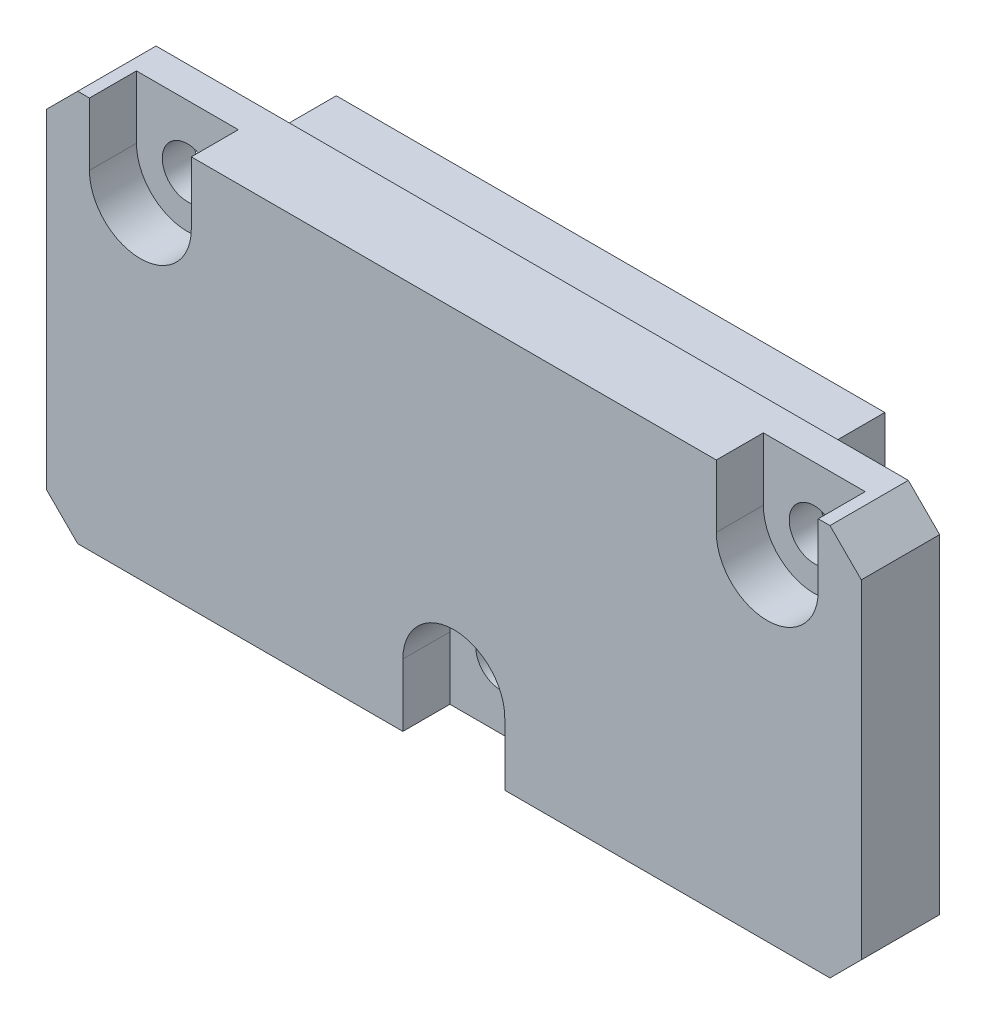
ISO-10303-21;
HEADER;
FILE_DESCRIPTION(('STEP AP214'),'2;1');
FILE_NAME('part.step','',(''),(''),'','','');
FILE_SCHEMA(('AUTOMOTIVE_DESIGN { 1 0 10303 214 1 1 1 1 }'));
ENDSEC;
DATA;
#1=APPLICATION_CONTEXT('core data for automotive mechanical design processes');
#2=APPLICATION_PROTOCOL_DEFINITION('international standard','automotive_design',2000,#1);
#3=PRODUCT_CONTEXT('',#1,'mechanical');
#4=PRODUCT('Part','Part','',(#3));
#5=PRODUCT_RELATED_PRODUCT_CATEGORY('part','',(#4));
#6=PRODUCT_DEFINITION_FORMATION('','',#4);
#7=PRODUCT_DEFINITION_CONTEXT('part definition',#1,'design');
#8=PRODUCT_DEFINITION('design','',#6,#7);
#9=PRODUCT_DEFINITION_SHAPE('','',#8);
#10=(LENGTH_UNIT() NAMED_UNIT(*) SI_UNIT(.MILLI.,.METRE.));
#11=(NAMED_UNIT(*) PLANE_ANGLE_UNIT() SI_UNIT($,.RADIAN.));
#12=(NAMED_UNIT(*) SI_UNIT($,.STERADIAN.) SOLID_ANGLE_UNIT());
#13=UNCERTAINTY_MEASURE_WITH_UNIT(LENGTH_MEASURE(1.E-05),#10,'distance_accuracy_value','');
#14=(GEOMETRIC_REPRESENTATION_CONTEXT(3) GLOBAL_UNCERTAINTY_ASSIGNED_CONTEXT((#13)) GLOBAL_UNIT_ASSIGNED_CONTEXT((#10,
#11,#12)) REPRESENTATION_CONTEXT('',''));
#15=CARTESIAN_POINT('',(0.,0.,0.));
#16=DIRECTION('',(0.,0.,1.));
#17=DIRECTION('',(1.,0.,0.));
#18=AXIS2_PLACEMENT_3D('',#15,#16,#17);
#19=CARTESIAN_POINT('',(-26.,12.5,5.));
#20=DIRECTION('',(0.,-1.,0.));
#21=DIRECTION('',(0.,0.,-1.));
#22=AXIS2_PLACEMENT_3D('',#19,#20,#21);
#23=PLANE('',#22);
#24=DIRECTION('',(0.,0.,1.));
#25=VECTOR('',#24,1.);
#26=CARTESIAN_POINT('',(16.75,12.5,2.));
#27=LINE('',#26,#25);
#28=CARTESIAN_POINT('',(16.75,12.5,2.));
#29=VERTEX_POINT('',#28);
#30=CARTESIAN_POINT('',(16.75,12.5,5.));
#31=VERTEX_POINT('',#30);
#32=EDGE_CURVE('E229',#29,#31,#27,.T.);
#33=ORIENTED_EDGE('',*,*,#32,.F.);
#34=DIRECTION('',(-1.,0.,0.));
#35=VECTOR('',#34,1.);
#36=CARTESIAN_POINT('',(0.,12.5,2.));
#37=LINE('',#36,#35);
#38=CARTESIAN_POINT('',(23.25,12.5,2.));
#39=VERTEX_POINT('',#38);
#40=EDGE_CURVE('E210',#39,#29,#37,.T.);
#41=ORIENTED_EDGE('',*,*,#40,.F.);
#42=DIRECTION('',(0.,0.,1.));
#43=VECTOR('',#42,1.);
#44=CARTESIAN_POINT('',(23.25,12.5,2.));
#45=LINE('',#44,#43);
#46=CARTESIAN_POINT('',(23.25,12.5,5.));
#47=VERTEX_POINT('',#46);
#48=EDGE_CURVE('E200',#39,#47,#45,.T.);
#49=ORIENTED_EDGE('',*,*,#48,.T.);
#50=DIRECTION('',(-1.,0.,0.));
#51=VECTOR('',#50,1.);
#52=CARTESIAN_POINT('',(-26.,12.5,5.));
#53=LINE('',#52,#51);
#54=CARTESIAN_POINT('',(24.,12.5,5.));
#55=VERTEX_POINT('',#54);
#56=EDGE_CURVE('E321',#55,#47,#53,.T.);
#57=ORIENTED_EDGE('',*,*,#56,.F.);
#58=DIRECTION('',(0.,0.,-1.));
#59=VECTOR('',#58,1.);
#60=CARTESIAN_POINT('',(24.,12.5,5.));
#61=LINE('',#60,#59);
#62=CARTESIAN_POINT('',(24.,12.5,0.));
#63=VERTEX_POINT('',#62);
#64=EDGE_CURVE('E42',#55,#63,#61,.T.);
#65=ORIENTED_EDGE('',*,*,#64,.T.);
#66=DIRECTION('',(-1.,0.,0.));
#67=VECTOR('',#66,1.);
#68=CARTESIAN_POINT('',(-26.,12.5,0.));
#69=LINE('',#68,#67);
#70=CARTESIAN_POINT('',(-24.,12.5,0.));
#71=VERTEX_POINT('',#70);
#72=EDGE_CURVE('E335',#63,#71,#69,.T.);
#73=ORIENTED_EDGE('',*,*,#72,.T.);
#74=DIRECTION('',(0.,0.,1.));
#75=VECTOR('',#74,1.);
#76=CARTESIAN_POINT('',(-24.,12.5,5.));
#77=LINE('',#76,#75);
#78=CARTESIAN_POINT('',(-24.,12.5,5.));
#79=VERTEX_POINT('',#78);
#80=EDGE_CURVE('E11',#71,#79,#77,.T.);
#81=ORIENTED_EDGE('',*,*,#80,.T.);
#82=CARTESIAN_POINT('',(-23.25,12.5,5.));
#83=VERTEX_POINT('',#82);
#84=EDGE_CURVE('E319',#83,#79,#53,.T.);
#85=ORIENTED_EDGE('',*,*,#84,.F.);
#86=DIRECTION('',(0.,0.,1.));
#87=VECTOR('',#86,1.);
#88=CARTESIAN_POINT('',(-23.25,12.5,2.));
#89=LINE('',#88,#87);
#90=CARTESIAN_POINT('',(-23.25,12.5,2.));
#91=VERTEX_POINT('',#90);
#92=EDGE_CURVE('E250',#91,#83,#89,.T.);
#93=ORIENTED_EDGE('',*,*,#92,.F.);
#94=DIRECTION('',(-1.,0.,0.));
#95=VECTOR('',#94,1.);
#96=CARTESIAN_POINT('',(0.,12.5,2.));
#97=LINE('',#96,#95);
#98=CARTESIAN_POINT('',(-16.75,12.5,2.));
#99=VERTEX_POINT('',#98);
#100=EDGE_CURVE('E240',#99,#91,#97,.T.);
#101=ORIENTED_EDGE('',*,*,#100,.F.);
#102=DIRECTION('',(0.,0.,1.));
#103=VECTOR('',#102,1.);
#104=CARTESIAN_POINT('',(-16.75,12.5,2.));
#105=LINE('',#104,#103);
#106=CARTESIAN_POINT('',(-16.75,12.5,5.));
#107=VERTEX_POINT('',#106);
#108=EDGE_CURVE('E253',#99,#107,#105,.T.);
#109=ORIENTED_EDGE('',*,*,#108,.T.);
#110=EDGE_CURVE('E325',#31,#107,#53,.T.);
#111=ORIENTED_EDGE('',*,*,#110,.F.);
#112=EDGE_LOOP('',(#33,#41,#49,#57,#65,#73,#81,#85,#93,#101,#109,#111));
#113=FACE_BOUND('',#112,.T.);
#114=ADVANCED_FACE('F34',(#113),#23,.F.);
#115=CARTESIAN_POINT('',(0.,0.,5.));
#116=DIRECTION('',(0.,0.,-1.));
#117=DIRECTION('',(-1.,0.,0.));
#118=AXIS2_PLACEMENT_3D('',#115,#116,#117);
#119=PLANE('',#118);
#120=DIRECTION('',(0.,1.,0.));
#121=VECTOR('',#120,1.);
#122=CARTESIAN_POINT('',(16.75,0.,5.));
#123=LINE('',#122,#121);
#124=CARTESIAN_POINT('',(16.75,8.5,5.));
#125=VERTEX_POINT('',#124);
#126=EDGE_CURVE('E214',#125,#31,#123,.T.);
#127=ORIENTED_EDGE('',*,*,#126,.T.);
#128=ORIENTED_EDGE('',*,*,#110,.T.);
#129=DIRECTION('',(0.,-1.,0.));
#130=VECTOR('',#129,1.);
#131=CARTESIAN_POINT('',(-16.75,0.,5.));
#132=LINE('',#131,#130);
#133=CARTESIAN_POINT('',(-16.75,8.5,5.));
#134=VERTEX_POINT('',#133);
#135=EDGE_CURVE('E235',#107,#134,#132,.T.);
#136=ORIENTED_EDGE('',*,*,#135,.T.);
#137=CARTESIAN_POINT('',(-20.,8.5,5.));
#138=DIRECTION('',(0.,0.,1.));
#139=DIRECTION('',(1.,0.,0.));
#140=AXIS2_PLACEMENT_3D('',#137,#138,#139);
#141=CIRCLE('',#140,3.25);
#142=CARTESIAN_POINT('',(-23.25,8.5,5.));
#143=VERTEX_POINT('',#142);
#144=EDGE_CURVE('E245',#143,#134,#141,.T.);
#145=ORIENTED_EDGE('',*,*,#144,.F.);
#146=DIRECTION('',(0.,1.,0.));
#147=VECTOR('',#146,1.);
#148=CARTESIAN_POINT('',(-23.25,0.,5.));
#149=LINE('',#148,#147);
#150=EDGE_CURVE('E57',#143,#83,#149,.T.);
#151=ORIENTED_EDGE('',*,*,#150,.T.);
#152=ORIENTED_EDGE('',*,*,#84,.T.);
#153=DIRECTION('',(0.707106781186549,0.707106781186546,0.));
#154=VECTOR('',#153,1.);
#155=CARTESIAN_POINT('',(-26.,10.5,5.));
#156=LINE('',#155,#154);
#157=CARTESIAN_POINT('',(-26.,10.5,5.));
#158=VERTEX_POINT('',#157);
#159=EDGE_CURVE('E363',#79,#158,#156,.F.);
#160=ORIENTED_EDGE('',*,*,#159,.T.);
#161=DIRECTION('',(0.,-1.,0.));
#162=VECTOR('',#161,1.);
#163=CARTESIAN_POINT('',(-26.,-12.5,5.));
#164=LINE('',#163,#162);
#165=CARTESIAN_POINT('',(-26.,-10.5,5.));
#166=VERTEX_POINT('',#165);
#167=EDGE_CURVE('E324',#158,#166,#164,.T.);
#168=ORIENTED_EDGE('',*,*,#167,.T.);
#169=DIRECTION('',(-0.707106781186545,0.70710678118655,0.));
#170=VECTOR('',#169,1.);
#171=CARTESIAN_POINT('',(-24.,-12.5,5.));
#172=LINE('',#171,#170);
#173=CARTESIAN_POINT('',(-24.,-12.5,5.));
#174=VERTEX_POINT('',#173);
#175=EDGE_CURVE('E365',#166,#174,#172,.F.);
#176=ORIENTED_EDGE('',*,*,#175,.T.);
#177=DIRECTION('',(1.,0.,0.));
#178=VECTOR('',#177,1.);
#179=CARTESIAN_POINT('',(-26.,-12.5,5.));
#180=LINE('',#179,#178);
#181=CARTESIAN_POINT('',(-3.25,-12.5,5.));
#182=VERTEX_POINT('',#181);
#183=EDGE_CURVE('E329',#174,#182,#180,.T.);
#184=ORIENTED_EDGE('',*,*,#183,.T.);
#185=DIRECTION('',(0.,-1.,0.));
#186=VECTOR('',#185,1.);
#187=CARTESIAN_POINT('',(-3.25,0.,5.));
#188=LINE('',#187,#186);
#189=CARTESIAN_POINT('',(-3.25,-8.5,5.));
#190=VERTEX_POINT('',#189);
#191=EDGE_CURVE('E273',#190,#182,#188,.T.);
#192=ORIENTED_EDGE('',*,*,#191,.F.);
#193=CARTESIAN_POINT('',(0.,-8.5,5.));
#194=DIRECTION('',(0.,0.,1.));
#195=DIRECTION('',(1.,0.,0.));
#196=AXIS2_PLACEMENT_3D('',#193,#194,#195);
#197=CIRCLE('',#196,3.25);
#198=CARTESIAN_POINT('',(3.25,-8.5,5.));
#199=VERTEX_POINT('',#198);
#200=EDGE_CURVE('E252',#199,#190,#197,.T.);
#201=ORIENTED_EDGE('',*,*,#200,.F.);
#202=DIRECTION('',(0.,1.,0.));
#203=VECTOR('',#202,1.);
#204=CARTESIAN_POINT('',(3.25,0.,5.));
#205=LINE('',#204,#203);
#206=CARTESIAN_POINT('',(3.25,-12.5,5.));
#207=VERTEX_POINT('',#206);
#208=EDGE_CURVE('E263',#207,#199,#205,.T.);
#209=ORIENTED_EDGE('',*,*,#208,.F.);
#210=CARTESIAN_POINT('',(24.,-12.5,5.));
#211=VERTEX_POINT('',#210);
#212=EDGE_CURVE('E328',#207,#211,#180,.T.);
#213=ORIENTED_EDGE('',*,*,#212,.T.);
#214=DIRECTION('',(-0.707106781186549,-0.707106781186546,0.));
#215=VECTOR('',#214,1.);
#216=CARTESIAN_POINT('',(26.,-10.5,5.));
#217=LINE('',#216,#215);
#218=CARTESIAN_POINT('',(26.,-10.5,5.));
#219=VERTEX_POINT('',#218);
#220=EDGE_CURVE('E367',#211,#219,#217,.F.);
#221=ORIENTED_EDGE('',*,*,#220,.T.);
#222=DIRECTION('',(0.,1.,0.));
#223=VECTOR('',#222,1.);
#224=CARTESIAN_POINT('',(26.,-12.5,5.));
#225=LINE('',#224,#223);
#226=CARTESIAN_POINT('',(26.,10.5,5.));
#227=VERTEX_POINT('',#226);
#228=EDGE_CURVE('E316',#219,#227,#225,.T.);
#229=ORIENTED_EDGE('',*,*,#228,.T.);
#230=DIRECTION('',(0.707106781186545,-0.70710678118655,0.));
#231=VECTOR('',#230,1.);
#232=CARTESIAN_POINT('',(24.,12.5,5.));
#233=LINE('',#232,#231);
#234=EDGE_CURVE('E361',#227,#55,#233,.F.);
#235=ORIENTED_EDGE('',*,*,#234,.T.);
#236=ORIENTED_EDGE('',*,*,#56,.T.);
#237=DIRECTION('',(0.,1.,0.));
#238=VECTOR('',#237,1.);
#239=CARTESIAN_POINT('',(23.25,0.,5.));
#240=LINE('',#239,#238);
#241=CARTESIAN_POINT('',(23.25,8.5,5.));
#242=VERTEX_POINT('',#241);
#243=EDGE_CURVE('E217',#242,#47,#240,.T.);
#244=ORIENTED_EDGE('',*,*,#243,.F.);
#245=CARTESIAN_POINT('',(20.,8.5,5.));
#246=DIRECTION('',(0.,0.,1.));
#247=DIRECTION('',(1.,0.,0.));
#248=AXIS2_PLACEMENT_3D('',#245,#246,#247);
#249=CIRCLE('',#248,3.25);
#250=EDGE_CURVE('E49',#125,#242,#249,.T.);
#251=ORIENTED_EDGE('',*,*,#250,.F.);
#252=EDGE_LOOP('',(#127,#128,#136,#145,#151,#152,#160,#168,#176,#184,#192,#201,#209,#213,#221,
#229,#235,#236,#244,#251));
#253=FACE_BOUND('',#252,.T.);
#254=ADVANCED_FACE('F397',(#253),#119,.F.);
#255=CARTESIAN_POINT('',(0.,0.,0.));
#256=DIRECTION('',(0.,0.,-1.));
#257=DIRECTION('',(-1.,0.,0.));
#258=AXIS2_PLACEMENT_3D('',#255,#256,#257);
#259=PLANE('',#258);
#260=CARTESIAN_POINT('',(20.,8.5,0.));
#261=DIRECTION('',(0.,0.,-1.));
#262=DIRECTION('',(-1.,0.,0.));
#263=AXIS2_PLACEMENT_3D('',#260,#261,#262);
#264=CIRCLE('',#263,1.6);
#265=CARTESIAN_POINT('',(18.4,8.5,0.));
#266=VERTEX_POINT('',#265);
#267=EDGE_CURVE('E695',#266,#266,#264,.T.);
#268=ORIENTED_EDGE('',*,*,#267,.F.);
#269=EDGE_LOOP('',(#268));
#270=FACE_BOUND('',#269,.T.);
#271=CARTESIAN_POINT('',(-20.,8.5,0.));
#272=DIRECTION('',(0.,0.,-1.));
#273=DIRECTION('',(-1.,0.,0.));
#274=AXIS2_PLACEMENT_3D('',#271,#272,#273);
#275=CIRCLE('',#274,1.6);
#276=CARTESIAN_POINT('',(-21.6,8.5,0.));
#277=VERTEX_POINT('',#276);
#278=EDGE_CURVE('E699',#277,#277,#275,.T.);
#279=ORIENTED_EDGE('',*,*,#278,.F.);
#280=EDGE_LOOP('',(#279));
#281=FACE_BOUND('',#280,.T.);
#282=CARTESIAN_POINT('',(0.,-8.5,0.));
#283=DIRECTION('',(0.,0.,-1.));
#284=DIRECTION('',(-1.,0.,0.));
#285=AXIS2_PLACEMENT_3D('',#282,#283,#284);
#286=CIRCLE('',#285,1.6);
#287=CARTESIAN_POINT('',(-1.6,-8.5,0.));
#288=VERTEX_POINT('',#287);
#289=EDGE_CURVE('E220',#288,#288,#286,.T.);
#290=ORIENTED_EDGE('',*,*,#289,.F.);
#291=EDGE_LOOP('',(#290));
#292=FACE_BOUND('',#291,.T.);
#293=DIRECTION('',(0.,1.,0.));
#294=VECTOR('',#293,1.);
#295=CARTESIAN_POINT('',(26.,-12.5,0.));
#296=LINE('',#295,#294);
#297=CARTESIAN_POINT('',(26.,-10.5,0.));
#298=VERTEX_POINT('',#297);
#299=CARTESIAN_POINT('',(26.,10.5,0.));
#300=VERTEX_POINT('',#299);
#301=EDGE_CURVE('E315',#298,#300,#296,.T.);
#302=ORIENTED_EDGE('',*,*,#301,.F.);
#303=DIRECTION('',(0.707106781186549,0.707106781186546,0.));
#304=VECTOR('',#303,1.);
#305=CARTESIAN_POINT('',(18.25,-18.25,0.));
#306=LINE('',#305,#304);
#307=CARTESIAN_POINT('',(24.,-12.5,0.));
#308=VERTEX_POINT('',#307);
#309=EDGE_CURVE('E353',#298,#308,#306,.F.);
#310=ORIENTED_EDGE('',*,*,#309,.T.);
#311=DIRECTION('',(1.,0.,0.));
#312=VECTOR('',#311,1.);
#313=CARTESIAN_POINT('',(-26.,-12.5,0.));
#314=LINE('',#313,#312);
#315=CARTESIAN_POINT('',(-24.,-12.5,0.));
#316=VERTEX_POINT('',#315);
#317=EDGE_CURVE('E320',#316,#308,#314,.T.);
#318=ORIENTED_EDGE('',*,*,#317,.F.);
#319=DIRECTION('',(0.707106781186545,-0.70710678118655,0.));
#320=VECTOR('',#319,1.);
#321=CARTESIAN_POINT('',(-18.2500000000001,-18.25,0.));
#322=LINE('',#321,#320);
#323=CARTESIAN_POINT('',(-26.,-10.5,0.));
#324=VERTEX_POINT('',#323);
#325=EDGE_CURVE('E351',#316,#324,#322,.F.);
#326=ORIENTED_EDGE('',*,*,#325,.T.);
#327=DIRECTION('',(0.,-1.,0.));
#328=VECTOR('',#327,1.);
#329=CARTESIAN_POINT('',(-26.,-12.5,0.));
#330=LINE('',#329,#328);
#331=CARTESIAN_POINT('',(-26.,10.5,0.));
#332=VERTEX_POINT('',#331);
#333=EDGE_CURVE('E338',#332,#324,#330,.T.);
#334=ORIENTED_EDGE('',*,*,#333,.F.);
#335=DIRECTION('',(-0.707106781186549,-0.707106781186546,0.));
#336=VECTOR('',#335,1.);
#337=CARTESIAN_POINT('',(-18.25,18.25,0.));
#338=LINE('',#337,#336);
#339=EDGE_CURVE('E349',#332,#71,#338,.F.);
#340=ORIENTED_EDGE('',*,*,#339,.T.);
#341=ORIENTED_EDGE('',*,*,#72,.F.);
#342=DIRECTION('',(-0.707106781186545,0.70710678118655,0.));
#343=VECTOR('',#342,1.);
#344=CARTESIAN_POINT('',(18.2500000000001,18.25,0.));
#345=LINE('',#344,#343);
#346=EDGE_CURVE('E347',#63,#300,#345,.F.);
#347=ORIENTED_EDGE('',*,*,#346,.T.);
#348=EDGE_LOOP('',(#302,#310,#318,#326,#334,#340,#341,#347));
#349=FACE_BOUND('',#348,.T.);
#350=DIRECTION('',(-1.,0.,0.));
#351=VECTOR('',#350,1.);
#352=CARTESIAN_POINT('',(-17.5,-4.5,0.));
#353=LINE('',#352,#351);
#354=CARTESIAN_POINT('',(17.5,-4.5,0.));
#355=VERTEX_POINT('',#354);
#356=CARTESIAN_POINT('',(-17.5,-4.5,0.));
#357=VERTEX_POINT('',#356);
#358=EDGE_CURVE('E300',#355,#357,#353,.T.);
#359=ORIENTED_EDGE('',*,*,#358,.F.);
#360=DIRECTION('',(0.,-1.,0.));
#361=VECTOR('',#360,1.);
#362=CARTESIAN_POINT('',(17.5,-4.5,0.));
#363=LINE('',#362,#361);
#364=CARTESIAN_POINT('',(17.5,10.5,0.));
#365=VERTEX_POINT('',#364);
#366=EDGE_CURVE('E279',#365,#355,#363,.T.);
#367=ORIENTED_EDGE('',*,*,#366,.F.);
#368=DIRECTION('',(1.,0.,0.));
#369=VECTOR('',#368,1.);
#370=CARTESIAN_POINT('',(-17.5,10.5,0.));
#371=LINE('',#370,#369);
#372=CARTESIAN_POINT('',(-17.5,10.5,0.));
#373=VERTEX_POINT('',#372);
#374=EDGE_CURVE('E291',#373,#365,#371,.T.);
#375=ORIENTED_EDGE('',*,*,#374,.F.);
#376=DIRECTION('',(0.,1.,0.));
#377=VECTOR('',#376,1.);
#378=CARTESIAN_POINT('',(-17.5,-4.5,0.));
#379=LINE('',#378,#377);
#380=EDGE_CURVE('E302',#357,#373,#379,.T.);
#381=ORIENTED_EDGE('',*,*,#380,.F.);
#382=EDGE_LOOP('',(#359,#367,#375,#381));
#383=FACE_BOUND('',#382,.T.);
#384=ADVANCED_FACE('F384',(#270,#281,#292,#349,#383),#259,.T.);
#385=CARTESIAN_POINT('',(26.,-12.5,5.));
#386=DIRECTION('',(-1.,0.,0.));
#387=DIRECTION('',(0.,0.,1.));
#388=AXIS2_PLACEMENT_3D('',#385,#386,#387);
#389=PLANE('',#388);
#390=ORIENTED_EDGE('',*,*,#228,.F.);
#391=DIRECTION('',(0.,0.,-1.));
#392=VECTOR('',#391,1.);
#393=CARTESIAN_POINT('',(26.,-10.5,5.));
#394=LINE('',#393,#392);
#395=EDGE_CURVE('E344',#219,#298,#394,.T.);
#396=ORIENTED_EDGE('',*,*,#395,.T.);
#397=ORIENTED_EDGE('',*,*,#301,.T.);
#398=DIRECTION('',(0.,0.,1.));
#399=VECTOR('',#398,1.);
#400=CARTESIAN_POINT('',(26.,10.5,5.));
#401=LINE('',#400,#399);
#402=EDGE_CURVE('E332',#300,#227,#401,.T.);
#403=ORIENTED_EDGE('',*,*,#402,.T.);
#404=EDGE_LOOP('',(#390,#396,#397,#403));
#405=FACE_BOUND('',#404,.T.);
#406=ADVANCED_FACE('F413',(#405),#389,.F.);
#407=CARTESIAN_POINT('',(-26.,-12.5,5.));
#408=DIRECTION('',(1.,0.,0.));
#409=DIRECTION('',(0.,0.,-1.));
#410=AXIS2_PLACEMENT_3D('',#407,#408,#409);
#411=PLANE('',#410);
#412=ORIENTED_EDGE('',*,*,#333,.T.);
#413=DIRECTION('',(0.,0.,1.));
#414=VECTOR('',#413,1.);
#415=CARTESIAN_POINT('',(-26.,-10.5,5.));
#416=LINE('',#415,#414);
#417=EDGE_CURVE('E372',#324,#166,#416,.T.);
#418=ORIENTED_EDGE('',*,*,#417,.T.);
#419=ORIENTED_EDGE('',*,*,#167,.F.);
#420=DIRECTION('',(0.,0.,-1.));
#421=VECTOR('',#420,1.);
#422=CARTESIAN_POINT('',(-26.,10.5,5.));
#423=LINE('',#422,#421);
#424=EDGE_CURVE('E369',#158,#332,#423,.T.);
#425=ORIENTED_EDGE('',*,*,#424,.T.);
#426=EDGE_LOOP('',(#412,#418,#419,#425));
#427=FACE_BOUND('',#426,.T.);
#428=ADVANCED_FACE('F393',(#427),#411,.F.);
#429=CARTESIAN_POINT('',(-26.,-12.5,5.));
#430=DIRECTION('',(0.,1.,0.));
#431=DIRECTION('',(0.,0.,1.));
#432=AXIS2_PLACEMENT_3D('',#429,#430,#431);
#433=PLANE('',#432);
#434=ORIENTED_EDGE('',*,*,#212,.F.);
#435=DIRECTION('',(0.,0.,1.));
#436=VECTOR('',#435,1.);
#437=CARTESIAN_POINT('',(3.25,-12.5,2.));
#438=LINE('',#437,#436);
#439=CARTESIAN_POINT('',(3.25,-12.5,2.));
#440=VERTEX_POINT('',#439);
#441=EDGE_CURVE('E280',#440,#207,#438,.T.);
#442=ORIENTED_EDGE('',*,*,#441,.F.);
#443=DIRECTION('',(1.,0.,0.));
#444=VECTOR('',#443,1.);
#445=CARTESIAN_POINT('',(0.,-12.5,2.));
#446=LINE('',#445,#444);
#447=CARTESIAN_POINT('',(-3.25,-12.5,2.));
#448=VERTEX_POINT('',#447);
#449=EDGE_CURVE('E266',#448,#440,#446,.T.);
#450=ORIENTED_EDGE('',*,*,#449,.F.);
#451=DIRECTION('',(0.,0.,1.));
#452=VECTOR('',#451,1.);
#453=CARTESIAN_POINT('',(-3.25,-12.5,2.));
#454=LINE('',#453,#452);
#455=EDGE_CURVE('E282',#448,#182,#454,.T.);
#456=ORIENTED_EDGE('',*,*,#455,.T.);
#457=ORIENTED_EDGE('',*,*,#183,.F.);
#458=DIRECTION('',(0.,0.,-1.));
#459=VECTOR('',#458,1.);
#460=CARTESIAN_POINT('',(-24.,-12.5,5.));
#461=LINE('',#460,#459);
#462=EDGE_CURVE('E355',#174,#316,#461,.T.);
#463=ORIENTED_EDGE('',*,*,#462,.T.);
#464=ORIENTED_EDGE('',*,*,#317,.T.);
#465=DIRECTION('',(0.,0.,1.));
#466=VECTOR('',#465,1.);
#467=CARTESIAN_POINT('',(24.,-12.5,5.));
#468=LINE('',#467,#466);
#469=EDGE_CURVE('E358',#308,#211,#468,.T.);
#470=ORIENTED_EDGE('',*,*,#469,.T.);
#471=EDGE_LOOP('',(#434,#442,#450,#456,#457,#463,#464,#470));
#472=FACE_BOUND('',#471,.T.);
#473=ADVANCED_FACE('F405',(#472),#433,.F.);
#474=CARTESIAN_POINT('',(26.,-10.5,5.));
#475=DIRECTION('',(-0.707106781186546,0.707106781186549,0.));
#476=DIRECTION('',(0.,0.,-1.));
#477=AXIS2_PLACEMENT_3D('',#474,#475,#476);
#478=PLANE('',#477);
#479=ORIENTED_EDGE('',*,*,#220,.F.);
#480=ORIENTED_EDGE('',*,*,#469,.F.);
#481=ORIENTED_EDGE('',*,*,#309,.F.);
#482=ORIENTED_EDGE('',*,*,#395,.F.);
#483=EDGE_LOOP('',(#479,#480,#481,#482));
#484=FACE_BOUND('',#483,.T.);
#485=ADVANCED_FACE('F410',(#484),#478,.F.);
#486=CARTESIAN_POINT('',(-24.,-12.5,5.));
#487=DIRECTION('',(0.70710678118655,0.707106781186545,0.));
#488=DIRECTION('',(0.,0.,-1.));
#489=AXIS2_PLACEMENT_3D('',#486,#487,#488);
#490=PLANE('',#489);
#491=ORIENTED_EDGE('',*,*,#175,.F.);
#492=ORIENTED_EDGE('',*,*,#417,.F.);
#493=ORIENTED_EDGE('',*,*,#325,.F.);
#494=ORIENTED_EDGE('',*,*,#462,.F.);
#495=EDGE_LOOP('',(#491,#492,#493,#494));
#496=FACE_BOUND('',#495,.T.);
#497=ADVANCED_FACE('F401',(#496),#490,.F.);
#498=CARTESIAN_POINT('',(-26.,10.5,5.));
#499=DIRECTION('',(0.707106781186546,-0.707106781186549,0.));
#500=DIRECTION('',(0.,0.,-1.));
#501=AXIS2_PLACEMENT_3D('',#498,#499,#500);
#502=PLANE('',#501);
#503=ORIENTED_EDGE('',*,*,#159,.F.);
#504=ORIENTED_EDGE('',*,*,#80,.F.);
#505=ORIENTED_EDGE('',*,*,#339,.F.);
#506=ORIENTED_EDGE('',*,*,#424,.F.);
#507=EDGE_LOOP('',(#503,#504,#505,#506));
#508=FACE_BOUND('',#507,.T.);
#509=ADVANCED_FACE('F390',(#508),#502,.F.);
#510=CARTESIAN_POINT('',(24.,12.5,5.));
#511=DIRECTION('',(-0.70710678118655,-0.707106781186545,0.));
#512=DIRECTION('',(0.,0.,-1.));
#513=AXIS2_PLACEMENT_3D('',#510,#511,#512);
#514=PLANE('',#513);
#515=ORIENTED_EDGE('',*,*,#234,.F.);
#516=ORIENTED_EDGE('',*,*,#402,.F.);
#517=ORIENTED_EDGE('',*,*,#346,.F.);
#518=ORIENTED_EDGE('',*,*,#64,.F.);
#519=EDGE_LOOP('',(#515,#516,#517,#518));
#520=FACE_BOUND('',#519,.T.);
#521=ADVANCED_FACE('F36',(#520),#514,.F.);
#522=CARTESIAN_POINT('',(17.5,-4.5,-5.));
#523=DIRECTION('',(-1.,0.,0.));
#524=DIRECTION('',(0.,0.,1.));
#525=AXIS2_PLACEMENT_3D('',#522,#523,#524);
#526=PLANE('',#525);
#527=ORIENTED_EDGE('',*,*,#366,.T.);
#528=DIRECTION('',(0.,0.,1.));
#529=VECTOR('',#528,1.);
#530=CARTESIAN_POINT('',(17.5,-4.5,-5.));
#531=LINE('',#530,#529);
#532=CARTESIAN_POINT('',(17.5,-4.5,-5.));
#533=VERTEX_POINT('',#532);
#534=EDGE_CURVE('E313',#533,#355,#531,.T.);
#535=ORIENTED_EDGE('',*,*,#534,.F.);
#536=DIRECTION('',(0.,-1.,0.));
#537=VECTOR('',#536,1.);
#538=CARTESIAN_POINT('',(17.5,-4.5,-5.));
#539=LINE('',#538,#537);
#540=CARTESIAN_POINT('',(17.5,10.5,-5.));
#541=VERTEX_POINT('',#540);
#542=EDGE_CURVE('E287',#541,#533,#539,.T.);
#543=ORIENTED_EDGE('',*,*,#542,.F.);
#544=DIRECTION('',(0.,0.,1.));
#545=VECTOR('',#544,1.);
#546=CARTESIAN_POINT('',(17.5,10.5,-5.));
#547=LINE('',#546,#545);
#548=EDGE_CURVE('E297',#541,#365,#547,.T.);
#549=ORIENTED_EDGE('',*,*,#548,.T.);
#550=EDGE_LOOP('',(#527,#535,#543,#549));
#551=FACE_BOUND('',#550,.T.);
#552=ADVANCED_FACE('F416',(#551),#526,.F.);
#553=CARTESIAN_POINT('',(-17.5,-4.5,-5.));
#554=DIRECTION('',(0.,1.,0.));
#555=DIRECTION('',(0.,0.,1.));
#556=AXIS2_PLACEMENT_3D('',#553,#554,#555);
#557=PLANE('',#556);
#558=ORIENTED_EDGE('',*,*,#358,.T.);
#559=DIRECTION('',(0.,0.,1.));
#560=VECTOR('',#559,1.);
#561=CARTESIAN_POINT('',(-17.5,-4.5,-5.));
#562=LINE('',#561,#560);
#563=CARTESIAN_POINT('',(-17.5,-4.5,-5.));
#564=VERTEX_POINT('',#563);
#565=EDGE_CURVE('E310',#564,#357,#562,.T.);
#566=ORIENTED_EDGE('',*,*,#565,.F.);
#567=DIRECTION('',(-1.,0.,0.));
#568=VECTOR('',#567,1.);
#569=CARTESIAN_POINT('',(-17.5,-4.5,-5.));
#570=LINE('',#569,#568);
#571=EDGE_CURVE('E290',#533,#564,#570,.T.);
#572=ORIENTED_EDGE('',*,*,#571,.F.);
#573=ORIENTED_EDGE('',*,*,#534,.T.);
#574=EDGE_LOOP('',(#558,#566,#572,#573));
#575=FACE_BOUND('',#574,.T.);
#576=ADVANCED_FACE('F421',(#575),#557,.F.);
#577=CARTESIAN_POINT('',(-17.5,-4.5,-5.));
#578=DIRECTION('',(1.,0.,0.));
#579=DIRECTION('',(0.,0.,-1.));
#580=AXIS2_PLACEMENT_3D('',#577,#578,#579);
#581=PLANE('',#580);
#582=ORIENTED_EDGE('',*,*,#380,.T.);
#583=DIRECTION('',(0.,0.,1.));
#584=VECTOR('',#583,1.);
#585=CARTESIAN_POINT('',(-17.5,10.5,-5.));
#586=LINE('',#585,#584);
#587=CARTESIAN_POINT('',(-17.5,10.5,-5.));
#588=VERTEX_POINT('',#587);
#589=EDGE_CURVE('E308',#588,#373,#586,.T.);
#590=ORIENTED_EDGE('',*,*,#589,.F.);
#591=DIRECTION('',(0.,1.,0.));
#592=VECTOR('',#591,1.);
#593=CARTESIAN_POINT('',(-17.5,-4.5,-5.));
#594=LINE('',#593,#592);
#595=EDGE_CURVE('E293',#564,#588,#594,.T.);
#596=ORIENTED_EDGE('',*,*,#595,.F.);
#597=ORIENTED_EDGE('',*,*,#565,.T.);
#598=EDGE_LOOP('',(#582,#590,#596,#597));
#599=FACE_BOUND('',#598,.T.);
#600=ADVANCED_FACE('F467',(#599),#581,.F.);
#601=CARTESIAN_POINT('',(-17.5,10.5,-5.));
#602=DIRECTION('',(0.,-1.,0.));
#603=DIRECTION('',(0.,0.,-1.));
#604=AXIS2_PLACEMENT_3D('',#601,#602,#603);
#605=PLANE('',#604);
#606=ORIENTED_EDGE('',*,*,#374,.T.);
#607=ORIENTED_EDGE('',*,*,#548,.F.);
#608=DIRECTION('',(1.,0.,0.));
#609=VECTOR('',#608,1.);
#610=CARTESIAN_POINT('',(-17.5,10.5,-5.));
#611=LINE('',#610,#609);
#612=EDGE_CURVE('E295',#588,#541,#611,.T.);
#613=ORIENTED_EDGE('',*,*,#612,.F.);
#614=ORIENTED_EDGE('',*,*,#589,.T.);
#615=EDGE_LOOP('',(#606,#607,#613,#614));
#616=FACE_BOUND('',#615,.T.);
#617=ADVANCED_FACE('F477',(#616),#605,.F.);
#618=CARTESIAN_POINT('',(0.,0.,-5.));
#619=DIRECTION('',(0.,0.,-1.));
#620=DIRECTION('',(-1.,0.,0.));
#621=AXIS2_PLACEMENT_3D('',#618,#619,#620);
#622=PLANE('',#621);
#623=ORIENTED_EDGE('',*,*,#542,.T.);
#624=ORIENTED_EDGE('',*,*,#571,.T.);
#625=ORIENTED_EDGE('',*,*,#595,.T.);
#626=ORIENTED_EDGE('',*,*,#612,.T.);
#627=EDGE_LOOP('',(#623,#624,#625,#626));
#628=FACE_BOUND('',#627,.T.);
#629=ADVANCED_FACE('F487',(#628),#622,.T.);
#630=CARTESIAN_POINT('',(0.,-8.5,2.));
#631=DIRECTION('',(0.,0.,1.));
#632=DIRECTION('',(1.,0.,0.));
#633=AXIS2_PLACEMENT_3D('',#630,#631,#632);
#634=CYLINDRICAL_SURFACE('',#633,3.25);
#635=ORIENTED_EDGE('',*,*,#200,.T.);
#636=DIRECTION('',(0.,0.,1.));
#637=VECTOR('',#636,1.);
#638=CARTESIAN_POINT('',(-3.25,-8.5,2.));
#639=LINE('',#638,#637);
#640=CARTESIAN_POINT('',(-3.25,-8.5,2.));
#641=VERTEX_POINT('',#640);
#642=EDGE_CURVE('E271',#641,#190,#639,.T.);
#643=ORIENTED_EDGE('',*,*,#642,.F.);
#644=CARTESIAN_POINT('',(0.,-8.5,2.));
#645=DIRECTION('',(0.,0.,1.));
#646=DIRECTION('',(1.,0.,0.));
#647=AXIS2_PLACEMENT_3D('',#644,#645,#646);
#648=CIRCLE('',#647,3.25);
#649=CARTESIAN_POINT('',(3.25,-8.5,2.));
#650=VERTEX_POINT('',#649);
#651=EDGE_CURVE('E259',#650,#641,#648,.T.);
#652=ORIENTED_EDGE('',*,*,#651,.F.);
#653=DIRECTION('',(0.,0.,1.));
#654=VECTOR('',#653,1.);
#655=CARTESIAN_POINT('',(3.25,-8.5,2.));
#656=LINE('',#655,#654);
#657=EDGE_CURVE('E277',#650,#199,#656,.T.);
#658=ORIENTED_EDGE('',*,*,#657,.T.);
#659=EDGE_LOOP('',(#635,#643,#652,#658));
#660=FACE_BOUND('',#659,.T.);
#661=ADVANCED_FACE('F497',(#660),#634,.F.);
#662=CARTESIAN_POINT('',(3.25,0.,2.));
#663=DIRECTION('',(1.,0.,0.));
#664=DIRECTION('',(0.,1.,0.));
#665=AXIS2_PLACEMENT_3D('',#662,#663,#664);
#666=PLANE('',#665);
#667=ORIENTED_EDGE('',*,*,#208,.T.);
#668=ORIENTED_EDGE('',*,*,#657,.F.);
#669=DIRECTION('',(0.,1.,0.));
#670=VECTOR('',#669,1.);
#671=CARTESIAN_POINT('',(3.25,0.,2.));
#672=LINE('',#671,#670);
#673=EDGE_CURVE('E268',#440,#650,#672,.T.);
#674=ORIENTED_EDGE('',*,*,#673,.F.);
#675=ORIENTED_EDGE('',*,*,#441,.T.);
#676=EDGE_LOOP('',(#667,#668,#674,#675));
#677=FACE_BOUND('',#676,.T.);
#678=ADVANCED_FACE('F508',(#677),#666,.F.);
#679=CARTESIAN_POINT('',(-3.25,0.,2.));
#680=DIRECTION('',(-1.,0.,0.));
#681=DIRECTION('',(0.,-1.,0.));
#682=AXIS2_PLACEMENT_3D('',#679,#680,#681);
#683=PLANE('',#682);
#684=ORIENTED_EDGE('',*,*,#191,.T.);
#685=ORIENTED_EDGE('',*,*,#455,.F.);
#686=DIRECTION('',(0.,-1.,0.));
#687=VECTOR('',#686,1.);
#688=CARTESIAN_POINT('',(-3.25,0.,2.));
#689=LINE('',#688,#687);
#690=EDGE_CURVE('E262',#641,#448,#689,.T.);
#691=ORIENTED_EDGE('',*,*,#690,.F.);
#692=ORIENTED_EDGE('',*,*,#642,.T.);
#693=EDGE_LOOP('',(#684,#685,#691,#692));
#694=FACE_BOUND('',#693,.T.);
#695=ADVANCED_FACE('F519',(#694),#683,.F.);
#696=CARTESIAN_POINT('',(0.,0.,2.));
#697=DIRECTION('',(0.,0.,1.));
#698=DIRECTION('',(1.,0.,0.));
#699=AXIS2_PLACEMENT_3D('',#696,#697,#698);
#700=PLANE('',#699);
#701=CARTESIAN_POINT('',(0.,-8.5,2.));
#702=DIRECTION('',(0.,0.,1.));
#703=DIRECTION('',(1.,0.,0.));
#704=AXIS2_PLACEMENT_3D('',#701,#702,#703);
#705=CIRCLE('',#704,1.6);
#706=CARTESIAN_POINT('',(1.6,-8.5,2.));
#707=VERTEX_POINT('',#706);
#708=EDGE_CURVE('E702',#707,#707,#705,.T.);
#709=ORIENTED_EDGE('',*,*,#708,.F.);
#710=EDGE_LOOP('',(#709));
#711=FACE_BOUND('',#710,.T.);
#712=ORIENTED_EDGE('',*,*,#651,.T.);
#713=ORIENTED_EDGE('',*,*,#690,.T.);
#714=ORIENTED_EDGE('',*,*,#449,.T.);
#715=ORIENTED_EDGE('',*,*,#673,.T.);
#716=EDGE_LOOP('',(#712,#713,#714,#715));
#717=FACE_BOUND('',#716,.T.);
#718=ADVANCED_FACE('F529',(#711,#717),#700,.T.);
#719=CARTESIAN_POINT('',(-23.25,0.,2.));
#720=DIRECTION('',(1.,0.,0.));
#721=DIRECTION('',(0.,1.,0.));
#722=AXIS2_PLACEMENT_3D('',#719,#720,#721);
#723=PLANE('',#722);
#724=ORIENTED_EDGE('',*,*,#150,.F.);
#725=DIRECTION('',(0.,0.,1.));
#726=VECTOR('',#725,1.);
#727=CARTESIAN_POINT('',(-23.25,8.5,2.));
#728=LINE('',#727,#726);
#729=CARTESIAN_POINT('',(-23.25,8.5,2.));
#730=VERTEX_POINT('',#729);
#731=EDGE_CURVE('E243',#730,#143,#728,.T.);
#732=ORIENTED_EDGE('',*,*,#731,.F.);
#733=DIRECTION('',(0.,1.,0.));
#734=VECTOR('',#733,1.);
#735=CARTESIAN_POINT('',(-23.25,0.,2.));
#736=LINE('',#735,#734);
#737=EDGE_CURVE('E232',#730,#91,#736,.T.);
#738=ORIENTED_EDGE('',*,*,#737,.T.);
#739=ORIENTED_EDGE('',*,*,#92,.T.);
#740=EDGE_LOOP('',(#724,#732,#738,#739));
#741=FACE_BOUND('',#740,.T.);
#742=ADVANCED_FACE('F540',(#741),#723,.T.);
#743=CARTESIAN_POINT('',(-16.75,0.,2.));
#744=DIRECTION('',(-1.,0.,0.));
#745=DIRECTION('',(0.,-1.,0.));
#746=AXIS2_PLACEMENT_3D('',#743,#744,#745);
#747=PLANE('',#746);
#748=ORIENTED_EDGE('',*,*,#135,.F.);
#749=ORIENTED_EDGE('',*,*,#108,.F.);
#750=DIRECTION('',(0.,-1.,0.));
#751=VECTOR('',#750,1.);
#752=CARTESIAN_POINT('',(-16.75,0.,2.));
#753=LINE('',#752,#751);
#754=CARTESIAN_POINT('',(-16.75,8.5,2.));
#755=VERTEX_POINT('',#754);
#756=EDGE_CURVE('E238',#99,#755,#753,.T.);
#757=ORIENTED_EDGE('',*,*,#756,.T.);
#758=DIRECTION('',(0.,0.,1.));
#759=VECTOR('',#758,1.);
#760=CARTESIAN_POINT('',(-16.75,8.5,2.));
#761=LINE('',#760,#759);
#762=EDGE_CURVE('E256',#755,#134,#761,.T.);
#763=ORIENTED_EDGE('',*,*,#762,.T.);
#764=EDGE_LOOP('',(#748,#749,#757,#763));
#765=FACE_BOUND('',#764,.T.);
#766=ADVANCED_FACE('F550',(#765),#747,.T.);
#767=CARTESIAN_POINT('',(-20.,8.5,2.));
#768=DIRECTION('',(0.,0.,1.));
#769=DIRECTION('',(1.,0.,0.));
#770=AXIS2_PLACEMENT_3D('',#767,#768,#769);
#771=CYLINDRICAL_SURFACE('',#770,3.25);
#772=ORIENTED_EDGE('',*,*,#144,.T.);
#773=ORIENTED_EDGE('',*,*,#762,.F.);
#774=CARTESIAN_POINT('',(-20.,8.5,2.));
#775=DIRECTION('',(0.,0.,1.));
#776=DIRECTION('',(1.,0.,0.));
#777=AXIS2_PLACEMENT_3D('',#774,#775,#776);
#778=CIRCLE('',#777,3.25);
#779=EDGE_CURVE('E234',#730,#755,#778,.T.);
#780=ORIENTED_EDGE('',*,*,#779,.F.);
#781=ORIENTED_EDGE('',*,*,#731,.T.);
#782=EDGE_LOOP('',(#772,#773,#780,#781));
#783=FACE_BOUND('',#782,.T.);
#784=ADVANCED_FACE('F559',(#783),#771,.F.);
#785=CARTESIAN_POINT('',(0.,0.,2.));
#786=DIRECTION('',(0.,0.,1.));
#787=DIRECTION('',(1.,0.,0.));
#788=AXIS2_PLACEMENT_3D('',#785,#786,#787);
#789=PLANE('',#788);
#790=CARTESIAN_POINT('',(-20.,8.5,2.));
#791=DIRECTION('',(0.,0.,1.));
#792=DIRECTION('',(1.,0.,0.));
#793=AXIS2_PLACEMENT_3D('',#790,#791,#792);
#794=CIRCLE('',#793,1.6);
#795=CARTESIAN_POINT('',(-18.4,8.5,2.));
#796=VERTEX_POINT('',#795);
#797=EDGE_CURVE('E706',#796,#796,#794,.T.);
#798=ORIENTED_EDGE('',*,*,#797,.F.);
#799=EDGE_LOOP('',(#798));
#800=FACE_BOUND('',#799,.T.);
#801=ORIENTED_EDGE('',*,*,#737,.F.);
#802=ORIENTED_EDGE('',*,*,#779,.T.);
#803=ORIENTED_EDGE('',*,*,#756,.F.);
#804=ORIENTED_EDGE('',*,*,#100,.T.);
#805=EDGE_LOOP('',(#801,#802,#803,#804));
#806=FACE_BOUND('',#805,.T.);
#807=ADVANCED_FACE('F569',(#800,#806),#789,.T.);
#808=CARTESIAN_POINT('',(20.,8.5,2.));
#809=DIRECTION('',(0.,0.,1.));
#810=DIRECTION('',(1.,0.,0.));
#811=AXIS2_PLACEMENT_3D('',#808,#809,#810);
#812=CYLINDRICAL_SURFACE('',#811,3.25);
#813=ORIENTED_EDGE('',*,*,#250,.T.);
#814=DIRECTION('',(0.,0.,1.));
#815=VECTOR('',#814,1.);
#816=CARTESIAN_POINT('',(23.25,8.5,2.));
#817=LINE('',#816,#815);
#818=CARTESIAN_POINT('',(23.25,8.5,2.));
#819=VERTEX_POINT('',#818);
#820=EDGE_CURVE('E193',#819,#242,#817,.T.);
#821=ORIENTED_EDGE('',*,*,#820,.F.);
#822=CARTESIAN_POINT('',(20.,8.5,2.));
#823=DIRECTION('',(0.,0.,1.));
#824=DIRECTION('',(1.,0.,0.));
#825=AXIS2_PLACEMENT_3D('',#822,#823,#824);
#826=CIRCLE('',#825,3.25);
#827=CARTESIAN_POINT('',(16.75,8.5,2.));
#828=VERTEX_POINT('',#827);
#829=EDGE_CURVE('E197',#828,#819,#826,.T.);
#830=ORIENTED_EDGE('',*,*,#829,.F.);
#831=DIRECTION('',(0.,0.,1.));
#832=VECTOR('',#831,1.);
#833=CARTESIAN_POINT('',(16.75,8.5,2.));
#834=LINE('',#833,#832);
#835=EDGE_CURVE('E227',#828,#125,#834,.T.);
#836=ORIENTED_EDGE('',*,*,#835,.T.);
#837=EDGE_LOOP('',(#813,#821,#830,#836));
#838=FACE_BOUND('',#837,.T.);
#839=ADVANCED_FACE('F195',(#838),#812,.F.);
#840=CARTESIAN_POINT('',(16.75,0.,2.));
#841=DIRECTION('',(1.,0.,0.));
#842=DIRECTION('',(0.,0.,-1.));
#843=AXIS2_PLACEMENT_3D('',#840,#841,#842);
#844=PLANE('',#843);
#845=ORIENTED_EDGE('',*,*,#126,.F.);
#846=ORIENTED_EDGE('',*,*,#835,.F.);
#847=DIRECTION('',(0.,1.,0.));
#848=VECTOR('',#847,1.);
#849=CARTESIAN_POINT('',(16.75,0.,2.));
#850=LINE('',#849,#848);
#851=EDGE_CURVE('E201',#828,#29,#850,.T.);
#852=ORIENTED_EDGE('',*,*,#851,.T.);
#853=ORIENTED_EDGE('',*,*,#32,.T.);
#854=EDGE_LOOP('',(#845,#846,#852,#853));
#855=FACE_BOUND('',#854,.T.);
#856=ADVANCED_FACE('F589',(#855),#844,.T.);
#857=CARTESIAN_POINT('',(23.25,0.,2.));
#858=DIRECTION('',(1.,0.,0.));
#859=DIRECTION('',(0.,0.,-1.));
#860=AXIS2_PLACEMENT_3D('',#857,#858,#859);
#861=PLANE('',#860);
#862=ORIENTED_EDGE('',*,*,#243,.T.);
#863=ORIENTED_EDGE('',*,*,#48,.F.);
#864=DIRECTION('',(0.,1.,0.));
#865=VECTOR('',#864,1.);
#866=CARTESIAN_POINT('',(23.25,0.,2.));
#867=LINE('',#866,#865);
#868=EDGE_CURVE('E204',#819,#39,#867,.T.);
#869=ORIENTED_EDGE('',*,*,#868,.F.);
#870=ORIENTED_EDGE('',*,*,#820,.T.);
#871=EDGE_LOOP('',(#862,#863,#869,#870));
#872=FACE_BOUND('',#871,.T.);
#873=ADVANCED_FACE('F205',(#872),#861,.F.);
#874=CARTESIAN_POINT('',(0.,0.,2.));
#875=DIRECTION('',(0.,0.,1.));
#876=DIRECTION('',(1.,0.,0.));
#877=AXIS2_PLACEMENT_3D('',#874,#875,#876);
#878=PLANE('',#877);
#879=CARTESIAN_POINT('',(20.,8.5,2.));
#880=DIRECTION('',(0.,0.,1.));
#881=DIRECTION('',(1.,0.,0.));
#882=AXIS2_PLACEMENT_3D('',#879,#880,#881);
#883=CIRCLE('',#882,1.6);
#884=CARTESIAN_POINT('',(21.6,8.5,2.));
#885=VERTEX_POINT('',#884);
#886=EDGE_CURVE('E712',#885,#885,#883,.T.);
#887=ORIENTED_EDGE('',*,*,#886,.F.);
#888=EDGE_LOOP('',(#887));
#889=FACE_BOUND('',#888,.T.);
#890=ORIENTED_EDGE('',*,*,#829,.T.);
#891=ORIENTED_EDGE('',*,*,#868,.T.);
#892=ORIENTED_EDGE('',*,*,#40,.T.);
#893=ORIENTED_EDGE('',*,*,#851,.F.);
#894=EDGE_LOOP('',(#890,#891,#892,#893));
#895=FACE_BOUND('',#894,.T.);
#896=ADVANCED_FACE('F213',(#889,#895),#878,.T.);
#897=CARTESIAN_POINT('',(0.,-8.5,-5.));
#898=DIRECTION('',(0.,0.,1.));
#899=DIRECTION('',(1.,0.,0.));
#900=AXIS2_PLACEMENT_3D('',#897,#898,#899);
#901=CYLINDRICAL_SURFACE('',#900,1.6);
#902=ORIENTED_EDGE('',*,*,#289,.T.);
#903=EDGE_LOOP('',(#902));
#904=FACE_BOUND('',#903,.T.);
#905=ORIENTED_EDGE('',*,*,#708,.T.);
#906=EDGE_LOOP('',(#905));
#907=FACE_BOUND('',#906,.T.);
#908=ADVANCED_FACE('F616',(#904,#907),#901,.F.);
#909=CARTESIAN_POINT('',(-20.,8.5,-5.));
#910=DIRECTION('',(0.,0.,1.));
#911=DIRECTION('',(1.,0.,0.));
#912=AXIS2_PLACEMENT_3D('',#909,#910,#911);
#913=CYLINDRICAL_SURFACE('',#912,1.6);
#914=ORIENTED_EDGE('',*,*,#278,.T.);
#915=EDGE_LOOP('',(#914));
#916=FACE_BOUND('',#915,.T.);
#917=ORIENTED_EDGE('',*,*,#797,.T.);
#918=EDGE_LOOP('',(#917));
#919=FACE_BOUND('',#918,.T.);
#920=ADVANCED_FACE('F626',(#916,#919),#913,.F.);
#921=CARTESIAN_POINT('',(20.,8.5,-5.));
#922=DIRECTION('',(0.,0.,1.));
#923=DIRECTION('',(1.,0.,0.));
#924=AXIS2_PLACEMENT_3D('',#921,#922,#923);
#925=CYLINDRICAL_SURFACE('',#924,1.6);
#926=ORIENTED_EDGE('',*,*,#267,.T.);
#927=EDGE_LOOP('',(#926));
#928=FACE_BOUND('',#927,.T.);
#929=ORIENTED_EDGE('',*,*,#886,.T.);
#930=EDGE_LOOP('',(#929));
#931=FACE_BOUND('',#930,.T.);
#932=ADVANCED_FACE('F636',(#928,#931),#925,.F.);
#933=CLOSED_SHELL('',(#114,#254,#384,#406,#428,#473,#485,#497,#509,#521,#552,#576,#600,#617,
#629,#661,#678,#695,#718,#742,#766,#784,#807,#839,#856,#873,#896,#908,#920,#932));
#934=MANIFOLD_SOLID_BREP('B2',#933);
#935=ADVANCED_BREP_SHAPE_REPRESENTATION('',(#18,#934),#14);
#936=SHAPE_DEFINITION_REPRESENTATION(#9,#935);
ENDSEC;
END-ISO-10303-21;
